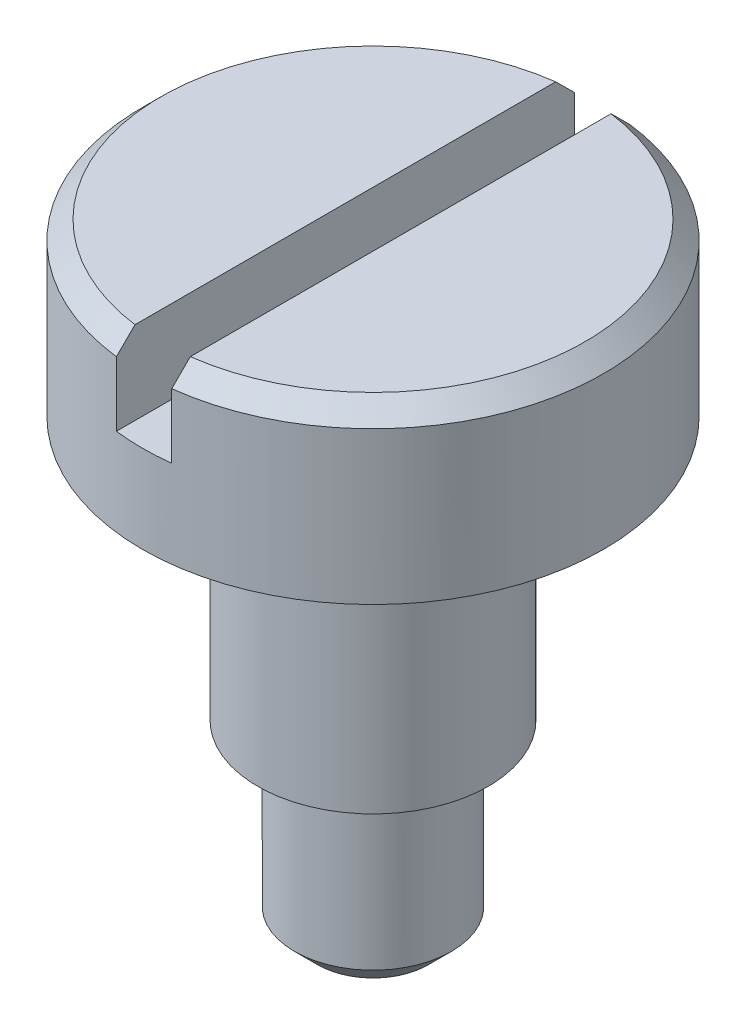
ISO-10303-21;
HEADER;
FILE_DESCRIPTION(('STEP AP214'),'2;1');
FILE_NAME('part.step','',(''),(''),'','','');
FILE_SCHEMA(('AUTOMOTIVE_DESIGN { 1 0 10303 214 1 1 1 1 }'));
ENDSEC;
DATA;
#1=APPLICATION_CONTEXT('core data for automotive mechanical design processes');
#2=APPLICATION_PROTOCOL_DEFINITION('international standard','automotive_design',2000,#1);
#3=PRODUCT_CONTEXT('',#1,'mechanical');
#4=PRODUCT('Part','Part','',(#3));
#5=PRODUCT_RELATED_PRODUCT_CATEGORY('part','',(#4));
#6=PRODUCT_DEFINITION_FORMATION('','',#4);
#7=PRODUCT_DEFINITION_CONTEXT('part definition',#1,'design');
#8=PRODUCT_DEFINITION('design','',#6,#7);
#9=PRODUCT_DEFINITION_SHAPE('','',#8);
#10=(LENGTH_UNIT() NAMED_UNIT(*) SI_UNIT(.MILLI.,.METRE.));
#11=(NAMED_UNIT(*) PLANE_ANGLE_UNIT() SI_UNIT($,.RADIAN.));
#12=(NAMED_UNIT(*) SI_UNIT($,.STERADIAN.) SOLID_ANGLE_UNIT());
#13=UNCERTAINTY_MEASURE_WITH_UNIT(LENGTH_MEASURE(1.E-05),#10,'distance_accuracy_value','');
#14=(GEOMETRIC_REPRESENTATION_CONTEXT(3) GLOBAL_UNCERTAINTY_ASSIGNED_CONTEXT((#13)) GLOBAL_UNIT_ASSIGNED_CONTEXT((#10,
#11,#12)) REPRESENTATION_CONTEXT('',''));
#15=CARTESIAN_POINT('',(0.,0.,0.));
#16=DIRECTION('',(0.,0.,1.));
#17=DIRECTION('',(1.,0.,0.));
#18=AXIS2_PLACEMENT_3D('',#15,#16,#17);
#19=CARTESIAN_POINT('',(0.,6.7,0.));
#20=DIRECTION('',(0.,1.,0.));
#21=DIRECTION('',(0.,0.,1.));
#22=AXIS2_PLACEMENT_3D('',#19,#20,#21);
#23=PLANE('',#22);
#24=DIRECTION('',(0.,0.,1.));
#25=VECTOR('',#24,1.);
#26=CARTESIAN_POINT('',(-0.3,6.7,-2.5));
#27=LINE('',#26,#25);
#28=CARTESIAN_POINT('',(-0.3,6.7,-2.28035085019828));
#29=VERTEX_POINT('',#28);
#30=CARTESIAN_POINT('',(-0.3,6.7,2.28035085019828));
#31=VERTEX_POINT('',#30);
#32=EDGE_CURVE('E119',#29,#31,#27,.T.);
#33=ORIENTED_EDGE('',*,*,#32,.F.);
#34=CARTESIAN_POINT('',(0.,6.7,0.));
#35=DIRECTION('',(0.,1.,0.));
#36=DIRECTION('',(0.,0.,1.));
#37=AXIS2_PLACEMENT_3D('',#34,#35,#36);
#38=CIRCLE('',#37,2.3);
#39=EDGE_CURVE('E124',#29,#31,#38,.T.);
#40=ORIENTED_EDGE('',*,*,#39,.T.);
#41=EDGE_LOOP('',(#33,#40));
#42=FACE_BOUND('',#41,.T.);
#43=ADVANCED_FACE('F51',(#42),#23,.T.);
#44=CARTESIAN_POINT('',(0.,6.7,0.));
#45=DIRECTION('',(0.,-1.,0.));
#46=DIRECTION('',(0.,0.,-1.));
#47=AXIS2_PLACEMENT_3D('',#44,#45,#46);
#48=CONICAL_SURFACE('',#47,2.3,0.785398163397449);
#49=CARTESIAN_POINT('',(-0.3,3.49740095923277,-5.49441500102172));
#50=CARTESIAN_POINT('',(-0.3,3.68437904184473,-5.30715620001564));
#51=CARTESIAN_POINT('',(-0.3,3.87134497413537,-5.11988525896128));
#52=CARTESIAN_POINT('',(-0.3,4.24523879282245,-4.74530183687046));
#53=CARTESIAN_POINT('',(-0.3,4.4321666788391,-4.55798935545493));
#54=CARTESIAN_POINT('',(-0.3,4.80600752109222,-4.18326864041074));
#55=CARTESIAN_POINT('',(-0.3,4.99292046535317,-3.99586039483432));
#56=CARTESIAN_POINT('',(-0.3,5.36666126046775,-3.62096252581089));
#57=CARTESIAN_POINT('',(-0.3,5.55348911209646,-3.43347290313678));
#58=CARTESIAN_POINT('',(-0.3,5.93259363628316,-3.05275236081743));
#59=CARTESIAN_POINT('',(-0.3,6.12486622374014,-2.85951737380285));
#60=CARTESIAN_POINT('',(-0.3,6.50916973886682,-2.47279638791687));
#61=CARTESIAN_POINT('',(-0.3,6.70120065974709,-2.27931038229033));
#62=CARTESIAN_POINT('',(-0.3,6.98883994321344,-1.98870504849486));
#63=CARTESIAN_POINT('',(-0.3,7.08464520469283,-1.89178063812496));
#64=CARTESIAN_POINT('',(-0.3,7.2760484612754,-1.69772498146762));
#65=CARTESIAN_POINT('',(-0.3,7.3716464541014,-1.60059373293074));
#66=CARTESIAN_POINT('',(-0.3,7.56248499619252,-1.40599070199035));
#67=CARTESIAN_POINT('',(-0.3,7.65772556354288,-1.30851893731182));
#68=CARTESIAN_POINT('',(-0.3,7.8475700351555,-1.11295789524718));
#69=CARTESIAN_POINT('',(-0.3,7.94217395453813,-1.01486863263448));
#70=CARTESIAN_POINT('',(-0.3,8.06135458075425,-0.889449161834405));
#71=CARTESIAN_POINT('',(-0.3,8.08660989895674,-0.862765153019541));
#72=CARTESIAN_POINT('',(-0.3,8.13697244199038,-0.809257484328843));
#73=CARTESIAN_POINT('',(-0.3,8.16207966464868,-0.782433822414863));
#74=CARTESIAN_POINT('',(-0.3,8.23697387926633,-0.701863728148212));
#75=CARTESIAN_POINT('',(-0.3,8.28648621187903,-0.647858293090638));
#76=CARTESIAN_POINT('',(-0.3,8.36791155472844,-0.55659925920069));
#77=CARTESIAN_POINT('',(-0.3,8.4002319010554,-0.519709452316788));
#78=CARTESIAN_POINT('',(-0.3,8.46391254944531,-0.444742714247727));
#79=CARTESIAN_POINT('',(-0.3,8.49526667156229,-0.406660416311502));
#80=CARTESIAN_POINT('',(-0.3,8.54073883723581,-0.347953844083806));
#81=CARTESIAN_POINT('',(-0.3,8.55571817198022,-0.328001395001935));
#82=CARTESIAN_POINT('',(-0.3,8.58476156349011,-0.287445666051435));
#83=CARTESIAN_POINT('',(-0.3,8.59882603484562,-0.266842687361308));
#84=CARTESIAN_POINT('',(-0.3,8.62543261767438,-0.224863157128301));
#85=CARTESIAN_POINT('',(-0.3,8.6379846957021,-0.203493029495873));
#86=CARTESIAN_POINT('',(-0.3,8.66072805776845,-0.159554908096857));
#87=CARTESIAN_POINT('',(-0.3,8.67092658182345,-0.13699085767192));
#88=CARTESIAN_POINT('',(-0.3,8.68546935898964,-0.0959344492746688));
#89=CARTESIAN_POINT('',(-0.3,8.69062790945145,-0.0777424058236855));
#90=CARTESIAN_POINT('',(-0.3,8.69777730964675,-0.0407827119720146));
#91=CARTESIAN_POINT('',(-0.3,8.69978090316367,-0.0220176909914338));
#92=CARTESIAN_POINT('',(-0.3,8.70018518531182,0.0156381589663874));
#93=CARTESIAN_POINT('',(-0.3,8.6985696883187,0.0345291748905424));
#94=CARTESIAN_POINT('',(-0.3,8.69208591362269,0.0717752076342206));
#95=CARTESIAN_POINT('',(-0.3,8.68720601879649,0.0901280649380028));
#96=CARTESIAN_POINT('',(-0.3,8.67470643947542,0.127028226162946));
#97=CARTESIAN_POINT('',(-0.3,8.66694415511521,0.145524972778849));
#98=CARTESIAN_POINT('',(-0.3,8.64963631889314,0.181678712199913));
#99=CARTESIAN_POINT('',(-0.3,8.64008739297465,0.199334035500835));
#100=CARTESIAN_POINT('',(-0.3,8.61974330234294,0.234083326816711));
#101=CARTESIAN_POINT('',(-0.3,8.60893902906366,0.251171865837647));
#102=CARTESIAN_POINT('',(-0.3,8.58653780503082,0.28479224562154));
#103=CARTESIAN_POINT('',(-0.3,8.57494157785009,0.301324574485331));
#104=CARTESIAN_POINT('',(-0.3,8.53712591947314,0.353359098089127));
#105=CARTESIAN_POINT('',(-0.3,8.50987442444216,0.388105482828248));
#106=CARTESIAN_POINT('',(-0.3,8.4540641554594,0.456538378601001));
#107=CARTESIAN_POINT('',(-0.3,8.42550457413641,0.490224212802764));
#108=CARTESIAN_POINT('',(-0.3,8.36757227673619,0.556992808389135));
#109=CARTESIAN_POINT('',(-0.3,8.33819821555706,0.590074401537634));
#110=CARTESIAN_POINT('',(-0.3,8.27898135488323,0.65579571299571));
#111=CARTESIAN_POINT('',(-0.3,8.24913868876631,0.688435552286678));
#112=CARTESIAN_POINT('',(-0.3,8.15933430051511,0.785715993452223));
#113=CARTESIAN_POINT('',(-0.3,8.09890916030533,0.849928070452521));
#114=CARTESIAN_POINT('',(-0.3,7.97750059498292,0.977693187892755));
#115=CARTESIAN_POINT('',(-0.3,7.91651780282345,1.04124683423659));
#116=CARTESIAN_POINT('',(-0.3,7.73356110975403,1.2308517311696));
#117=CARTESIAN_POINT('',(-0.3,7.61106147849989,1.35639527890478));
#118=CARTESIAN_POINT('',(-0.3,7.36548846923433,1.6069221557674));
#119=CARTESIAN_POINT('',(-0.3,7.24241507865409,1.73190547250363));
#120=CARTESIAN_POINT('',(-0.3,6.9959046371281,1.98161557427296));
#121=CARTESIAN_POINT('',(-0.3,6.87246745659262,2.10634223150332));
#122=CARTESIAN_POINT('',(-0.3,6.62541415244908,2.35561585955636));
#123=CARTESIAN_POINT('',(-0.3,6.5017980303684,2.48016283189483));
#124=CARTESIAN_POINT('',(-0.3,6.13075740493485,2.8536615007864));
#125=CARTESIAN_POINT('',(-0.3,5.88316497133436,3.10244637086134));
#126=CARTESIAN_POINT('',(-0.3,5.38780211847215,3.5997834009693));
#127=CARTESIAN_POINT('',(-0.3,5.14003172214028,3.84833558386133));
#128=CARTESIAN_POINT('',(-0.3,4.77600091553271,4.21334065594416));
#129=CARTESIAN_POINT('',(-0.3,4.65978679977968,4.32983970942582));
#130=CARTESIAN_POINT('',(-0.3,4.42733473190355,4.56282033079932));
#131=CARTESIAN_POINT('',(-0.3,4.31109677921989,4.67930189813183));
#132=CARTESIAN_POINT('',(-0.3,4.07862187134336,4.91223122439401));
#133=CARTESIAN_POINT('',(-0.3,3.96238491860602,5.02867898577443));
#134=CARTESIAN_POINT('',(-0.3,3.7299007150748,5.26155791420399));
#135=CARTESIAN_POINT('',(-0.3,3.61365346464633,5.3779890816179));
#136=CARTESIAN_POINT('',(-0.3,3.49740095923277,5.49441500102172));
#137=B_SPLINE_CURVE_WITH_KNOTS('',3,(#49,#50,#51,#52,#53,#54,#55,#56,#57,#58,#59,#60,#61,#62,
#63,#64,#65,#66,#67,#68,#69,#70,#71,#72,#73,#74,#75,#76,#77,#78,#79,#80,#81,#82,#83,#84,#85,#86,
#87,#88,#89,#90,#91,#92,#93,#94,#95,#96,#97,#98,#99,#100,#101,#102,#103,#104,#105,#106,#107,
#108,#109,#110,#111,#112,#113,#114,#115,#116,#117,#118,#119,#120,#121,#122,#123,#124,#125,#126,
#127,#128,#129,#130,#131,#132,#133,#134,#135,#136),.UNSPECIFIED.,.F.,.F.,(4,2,2,2,2,2,2,2,2,2,2,
2,2,2,2,2,2,2,2,2,2,2,2,2,2,2,2,2,2,2,2,2,2,2,2,2,2,2,2,2,2,2,2,4),(0.,0.793876546364031,
1.58776066268283,2.38181650155653,3.17586495682467,3.99365253034857,4.81146258775994,
5.22031074168229,5.62916336490971,6.03799501403457,6.44681691890672,6.55703786995822,
6.66726043414782,6.88704208752998,7.03417144534583,7.18210127994141,7.2569344365678,
7.33173344121863,7.40600889829883,7.48005272899999,7.53657161101339,7.5928616058636,
7.64940384825497,7.70614838754923,7.76618693055665,7.82634002164501,7.88696060016449,
7.94752651479469,8.079922895979,8.2124021254584,8.3451149740822,8.47779071011941,
8.7422974836184,9.00653421330329,9.53274606785147,10.0589695043175,10.5854110559238,
11.1118481402548,12.1648260581468,13.2176865404689,13.7113460853179,14.2050190064523,
14.6986180254373,15.1922036393833),.UNSPECIFIED.);
#138=CARTESIAN_POINT('',(-0.3,6.5,-2.48193472919818));
#139=VERTEX_POINT('',#138);
#140=EDGE_CURVE('E198',#139,#29,#137,.T.);
#141=ORIENTED_EDGE('',*,*,#140,.F.);
#142=CARTESIAN_POINT('',(0.,6.5,0.));
#143=DIRECTION('',(0.,1.,0.));
#144=DIRECTION('',(0.,0.,1.));
#145=AXIS2_PLACEMENT_3D('',#142,#143,#144);
#146=CIRCLE('',#145,2.5);
#147=CARTESIAN_POINT('',(-0.3,6.5,2.48193472919817));
#148=VERTEX_POINT('',#147);
#149=EDGE_CURVE('E126',#148,#139,#146,.F.);
#150=ORIENTED_EDGE('',*,*,#149,.F.);
#151=EDGE_CURVE('E112',#31,#148,#137,.T.);
#152=ORIENTED_EDGE('',*,*,#151,.F.);
#153=ORIENTED_EDGE('',*,*,#39,.F.);
#154=EDGE_LOOP('',(#141,#150,#152,#153));
#155=FACE_BOUND('',#154,.T.);
#156=ADVANCED_FACE('F173',(#155),#48,.T.);
#157=CARTESIAN_POINT('',(0.,2.,0.));
#158=DIRECTION('',(0.,-1.,0.));
#159=DIRECTION('',(0.,0.,-1.));
#160=AXIS2_PLACEMENT_3D('',#157,#158,#159);
#161=PLANE('',#160);
#162=CARTESIAN_POINT('',(0.,2.,0.));
#163=DIRECTION('',(0.,-1.,0.));
#164=DIRECTION('',(0.,0.,-1.));
#165=AXIS2_PLACEMENT_3D('',#162,#163,#164);
#166=CIRCLE('',#165,0.85);
#167=CARTESIAN_POINT('',(0.,2.,-0.85));
#168=VERTEX_POINT('',#167);
#169=EDGE_CURVE('E129',#168,#168,#166,.T.);
#170=ORIENTED_EDGE('',*,*,#169,.F.);
#171=EDGE_LOOP('',(#170));
#172=FACE_BOUND('',#171,.T.);
#173=CARTESIAN_POINT('',(0.,2.,0.));
#174=DIRECTION('',(0.,-1.,0.));
#175=DIRECTION('',(0.,0.,-1.));
#176=AXIS2_PLACEMENT_3D('',#173,#174,#175);
#177=CIRCLE('',#176,1.25);
#178=CARTESIAN_POINT('',(0.,2.,-1.25));
#179=VERTEX_POINT('',#178);
#180=EDGE_CURVE('E224',#179,#179,#177,.T.);
#181=ORIENTED_EDGE('',*,*,#180,.T.);
#182=EDGE_LOOP('',(#181));
#183=FACE_BOUND('',#182,.T.);
#184=ADVANCED_FACE('F169',(#172,#183),#161,.T.);
#185=CARTESIAN_POINT('',(0.,2.,0.));
#186=DIRECTION('',(0.,-1.,0.));
#187=DIRECTION('',(0.,0.,-1.));
#188=AXIS2_PLACEMENT_3D('',#185,#186,#187);
#189=CYLINDRICAL_SURFACE('',#188,0.85);
#190=CARTESIAN_POINT('',(0.,0.250000000000002,0.));
#191=DIRECTION('',(0.,1.,0.));
#192=DIRECTION('',(0.,0.,1.));
#193=AXIS2_PLACEMENT_3D('',#190,#191,#192);
#194=CIRCLE('',#193,0.85);
#195=CARTESIAN_POINT('',(0.,0.250000000000002,0.85));
#196=VERTEX_POINT('',#195);
#197=EDGE_CURVE('E208',#196,#196,#194,.T.);
#198=ORIENTED_EDGE('',*,*,#197,.T.);
#199=EDGE_LOOP('',(#198));
#200=FACE_BOUND('',#199,.T.);
#201=ORIENTED_EDGE('',*,*,#169,.T.);
#202=EDGE_LOOP('',(#201));
#203=FACE_BOUND('',#202,.T.);
#204=ADVANCED_FACE('F166',(#200,#203),#189,.T.);
#205=CARTESIAN_POINT('',(0.,0.,0.));
#206=DIRECTION('',(0.,1.,0.));
#207=DIRECTION('',(0.,0.,1.));
#208=AXIS2_PLACEMENT_3D('',#205,#206,#207);
#209=PLANE('',#208);
#210=CARTESIAN_POINT('',(0.,0.,0.));
#211=DIRECTION('',(0.,1.,0.));
#212=DIRECTION('',(0.,0.,1.));
#213=AXIS2_PLACEMENT_3D('',#210,#211,#212);
#214=CIRCLE('',#213,0.599999999999999);
#215=CARTESIAN_POINT('',(0.,0.,0.599999999999999));
#216=VERTEX_POINT('',#215);
#217=EDGE_CURVE('E204',#216,#216,#214,.F.);
#218=ORIENTED_EDGE('',*,*,#217,.T.);
#219=EDGE_LOOP('',(#218));
#220=FACE_BOUND('',#219,.T.);
#221=ADVANCED_FACE('F164',(#220),#209,.F.);
#222=CARTESIAN_POINT('',(0.,4.85,0.));
#223=DIRECTION('',(0.,-1.,0.));
#224=DIRECTION('',(0.,0.,-1.));
#225=AXIS2_PLACEMENT_3D('',#222,#223,#224);
#226=PLANE('',#225);
#227=CARTESIAN_POINT('',(0.,4.85,0.));
#228=DIRECTION('',(0.,-1.,0.));
#229=DIRECTION('',(0.,0.,-1.));
#230=AXIS2_PLACEMENT_3D('',#227,#228,#229);
#231=CIRCLE('',#230,1.35);
#232=CARTESIAN_POINT('',(0.,4.85,-1.35));
#233=VERTEX_POINT('',#232);
#234=EDGE_CURVE('E14',#233,#233,#231,.F.);
#235=ORIENTED_EDGE('',*,*,#234,.T.);
#236=EDGE_LOOP('',(#235));
#237=FACE_BOUND('',#236,.T.);
#238=CARTESIAN_POINT('',(0.,4.85,0.));
#239=DIRECTION('',(0.,-1.,0.));
#240=DIRECTION('',(0.,0.,-1.));
#241=AXIS2_PLACEMENT_3D('',#238,#239,#240);
#242=CIRCLE('',#241,2.5);
#243=CARTESIAN_POINT('',(0.,4.85,-2.5));
#244=VERTEX_POINT('',#243);
#245=EDGE_CURVE('E131',#244,#244,#242,.T.);
#246=ORIENTED_EDGE('',*,*,#245,.T.);
#247=EDGE_LOOP('',(#246));
#248=FACE_BOUND('',#247,.T.);
#249=ADVANCED_FACE('F160',(#237,#248),#226,.T.);
#250=CARTESIAN_POINT('',(0.,4.85,0.));
#251=DIRECTION('',(0.,-1.,0.));
#252=DIRECTION('',(0.,0.,-1.));
#253=AXIS2_PLACEMENT_3D('',#250,#251,#252);
#254=CYLINDRICAL_SURFACE('',#253,1.25);
#255=CARTESIAN_POINT('',(0.,4.75,0.));
#256=DIRECTION('',(0.,-1.,0.));
#257=DIRECTION('',(0.,0.,-1.));
#258=AXIS2_PLACEMENT_3D('',#255,#256,#257);
#259=CIRCLE('',#258,1.25);
#260=CARTESIAN_POINT('',(0.,4.75,-1.25));
#261=VERTEX_POINT('',#260);
#262=EDGE_CURVE('E59',#261,#261,#259,.T.);
#263=ORIENTED_EDGE('',*,*,#262,.T.);
#264=EDGE_LOOP('',(#263));
#265=FACE_BOUND('',#264,.T.);
#266=ORIENTED_EDGE('',*,*,#180,.F.);
#267=EDGE_LOOP('',(#266));
#268=FACE_BOUND('',#267,.T.);
#269=ADVANCED_FACE('F157',(#265,#268),#254,.T.);
#270=DIRECTION('',(0.,0.,1.));
#271=VECTOR('',#270,1.);
#272=CARTESIAN_POINT('',(0.3,6.7,-2.5));
#273=LINE('',#272,#271);
#274=CARTESIAN_POINT('',(0.3,6.7,-2.28035085019828));
#275=VERTEX_POINT('',#274);
#276=CARTESIAN_POINT('',(0.3,6.7,2.28035085019828));
#277=VERTEX_POINT('',#276);
#278=EDGE_CURVE('E66',#275,#277,#273,.T.);
#279=ORIENTED_EDGE('',*,*,#278,.T.);
#280=EDGE_CURVE('E118',#277,#275,#38,.T.);
#281=ORIENTED_EDGE('',*,*,#280,.T.);
#282=EDGE_LOOP('',(#279,#281));
#283=FACE_BOUND('',#282,.T.);
#284=ADVANCED_FACE('F117',(#283),#23,.T.);
#285=CARTESIAN_POINT('',(0.,6.7,0.));
#286=DIRECTION('',(0.,-1.,0.));
#287=DIRECTION('',(0.,0.,-1.));
#288=AXIS2_PLACEMENT_3D('',#285,#286,#287);
#289=CYLINDRICAL_SURFACE('',#288,2.5);
#290=CARTESIAN_POINT('',(0.,5.8,0.));
#291=DIRECTION('',(0.,-1.,0.));
#292=DIRECTION('',(0.,0.,-1.));
#293=AXIS2_PLACEMENT_3D('',#290,#291,#292);
#294=CIRCLE('',#293,2.5);
#295=CARTESIAN_POINT('',(-0.3,5.8,-2.48193472919817));
#296=VERTEX_POINT('',#295);
#297=CARTESIAN_POINT('',(0.3,5.8,-2.48193472919817));
#298=VERTEX_POINT('',#297);
#299=EDGE_CURVE('E203',#296,#298,#294,.T.);
#300=ORIENTED_EDGE('',*,*,#299,.T.);
#301=DIRECTION('',(0.,-1.,0.));
#302=VECTOR('',#301,1.);
#303=CARTESIAN_POINT('',(0.3,6.7,-2.48193472919817));
#304=LINE('',#303,#302);
#305=CARTESIAN_POINT('',(0.3,6.5,-2.48193472919817));
#306=VERTEX_POINT('',#305);
#307=EDGE_CURVE('E195',#298,#306,#304,.F.);
#308=ORIENTED_EDGE('',*,*,#307,.T.);
#309=CARTESIAN_POINT('',(0.3,6.5,2.48193472919818));
#310=VERTEX_POINT('',#309);
#311=EDGE_CURVE('E123',#306,#310,#146,.F.);
#312=ORIENTED_EDGE('',*,*,#311,.T.);
#313=DIRECTION('',(0.,-1.,0.));
#314=VECTOR('',#313,1.);
#315=CARTESIAN_POINT('',(0.3,6.7,2.48193472919817));
#316=LINE('',#315,#314);
#317=CARTESIAN_POINT('',(0.3,5.8,2.48193472919817));
#318=VERTEX_POINT('',#317);
#319=EDGE_CURVE('E107',#310,#318,#316,.T.);
#320=ORIENTED_EDGE('',*,*,#319,.T.);
#321=CARTESIAN_POINT('',(-0.3,5.8,2.48193472919817));
#322=VERTEX_POINT('',#321);
#323=EDGE_CURVE('E201',#318,#322,#294,.T.);
#324=ORIENTED_EDGE('',*,*,#323,.T.);
#325=DIRECTION('',(0.,-1.,0.));
#326=VECTOR('',#325,1.);
#327=CARTESIAN_POINT('',(-0.3,6.7,2.48193472919817));
#328=LINE('',#327,#326);
#329=EDGE_CURVE('E230',#322,#148,#328,.F.);
#330=ORIENTED_EDGE('',*,*,#329,.T.);
#331=ORIENTED_EDGE('',*,*,#149,.T.);
#332=DIRECTION('',(0.,-1.,0.));
#333=VECTOR('',#332,1.);
#334=CARTESIAN_POINT('',(-0.3,6.7,-2.48193472919817));
#335=LINE('',#334,#333);
#336=EDGE_CURVE('E74',#139,#296,#335,.T.);
#337=ORIENTED_EDGE('',*,*,#336,.T.);
#338=EDGE_LOOP('',(#300,#308,#312,#320,#324,#330,#331,#337));
#339=FACE_BOUND('',#338,.T.);
#340=ORIENTED_EDGE('',*,*,#245,.F.);
#341=EDGE_LOOP('',(#340));
#342=FACE_BOUND('',#341,.T.);
#343=ADVANCED_FACE('F177',(#339,#342),#289,.T.);
#344=CARTESIAN_POINT('',(0.3,3.49740095923277,5.49441500102172));
#345=CARTESIAN_POINT('',(0.3,3.68437904184473,5.30715620001564));
#346=CARTESIAN_POINT('',(0.3,3.87134497413537,5.11988525896128));
#347=CARTESIAN_POINT('',(0.3,4.24523879282245,4.74530183687046));
#348=CARTESIAN_POINT('',(0.3,4.4321666788391,4.55798935545493));
#349=CARTESIAN_POINT('',(0.3,4.80600752109222,4.18326864041074));
#350=CARTESIAN_POINT('',(0.3,4.99292046535317,3.99586039483432));
#351=CARTESIAN_POINT('',(0.3,5.36666126046775,3.62096252581089));
#352=CARTESIAN_POINT('',(0.3,5.55348911209646,3.43347290313678));
#353=CARTESIAN_POINT('',(0.3,5.93259363628316,3.05275236081743));
#354=CARTESIAN_POINT('',(0.3,6.12486622374014,2.85951737380285));
#355=CARTESIAN_POINT('',(0.3,6.50916973886682,2.47279638791687));
#356=CARTESIAN_POINT('',(0.3,6.70120065974709,2.27931038229033));
#357=CARTESIAN_POINT('',(0.3,6.98883994321344,1.98870504849486));
#358=CARTESIAN_POINT('',(0.3,7.08464520469283,1.89178063812496));
#359=CARTESIAN_POINT('',(0.3,7.2760484612754,1.69772498146762));
#360=CARTESIAN_POINT('',(0.3,7.3716464541014,1.60059373293074));
#361=CARTESIAN_POINT('',(0.3,7.56248499619252,1.40599070199035));
#362=CARTESIAN_POINT('',(0.3,7.65772556354288,1.30851893731182));
#363=CARTESIAN_POINT('',(0.3,7.8475700351555,1.11295789524718));
#364=CARTESIAN_POINT('',(0.3,7.94217395453813,1.01486863263448));
#365=CARTESIAN_POINT('',(0.3,8.06135458075425,0.889449161834405));
#366=CARTESIAN_POINT('',(0.3,8.08660989895674,0.862765153019541));
#367=CARTESIAN_POINT('',(0.3,8.13697244199038,0.809257484328843));
#368=CARTESIAN_POINT('',(0.3,8.16207966464868,0.782433822414863));
#369=CARTESIAN_POINT('',(0.3,8.23697387926633,0.701863728148212));
#370=CARTESIAN_POINT('',(0.3,8.28648621187903,0.647858293090638));
#371=CARTESIAN_POINT('',(0.3,8.36791155472844,0.55659925920069));
#372=CARTESIAN_POINT('',(0.3,8.4002319010554,0.519709452316788));
#373=CARTESIAN_POINT('',(0.3,8.46391254944531,0.444742714247727));
#374=CARTESIAN_POINT('',(0.3,8.49526667156229,0.406660416311502));
#375=CARTESIAN_POINT('',(0.3,8.54073883723581,0.347953844083806));
#376=CARTESIAN_POINT('',(0.3,8.55571817198022,0.328001395001935));
#377=CARTESIAN_POINT('',(0.3,8.58476156349011,0.287445666051435));
#378=CARTESIAN_POINT('',(0.3,8.59882603484562,0.266842687361308));
#379=CARTESIAN_POINT('',(0.3,8.62543261767438,0.224863157128301));
#380=CARTESIAN_POINT('',(0.3,8.6379846957021,0.203493029495873));
#381=CARTESIAN_POINT('',(0.3,8.66072805776845,0.159554908096857));
#382=CARTESIAN_POINT('',(0.3,8.67092658182345,0.13699085767192));
#383=CARTESIAN_POINT('',(0.3,8.68546935898964,0.0959344492746688));
#384=CARTESIAN_POINT('',(0.3,8.69062790945145,0.0777424058236855));
#385=CARTESIAN_POINT('',(0.3,8.69777730964675,0.0407827119720146));
#386=CARTESIAN_POINT('',(0.3,8.69978090316367,0.0220176909914338));
#387=CARTESIAN_POINT('',(0.3,8.70018518531182,-0.0156381589663874));
#388=CARTESIAN_POINT('',(0.3,8.6985696883187,-0.0345291748905424));
#389=CARTESIAN_POINT('',(0.3,8.69208591362269,-0.0717752076342206));
#390=CARTESIAN_POINT('',(0.3,8.68720601879649,-0.0901280649380028));
#391=CARTESIAN_POINT('',(0.3,8.67470643947542,-0.127028226162946));
#392=CARTESIAN_POINT('',(0.3,8.66694415511521,-0.145524972778849));
#393=CARTESIAN_POINT('',(0.3,8.64963631889314,-0.181678712199913));
#394=CARTESIAN_POINT('',(0.3,8.64008739297465,-0.199334035500835));
#395=CARTESIAN_POINT('',(0.3,8.61974330234294,-0.234083326816711));
#396=CARTESIAN_POINT('',(0.3,8.60893902906366,-0.251171865837647));
#397=CARTESIAN_POINT('',(0.3,8.58653780503082,-0.28479224562154));
#398=CARTESIAN_POINT('',(0.3,8.57494157785009,-0.301324574485331));
#399=CARTESIAN_POINT('',(0.3,8.53712591947314,-0.353359098089127));
#400=CARTESIAN_POINT('',(0.3,8.50987442444216,-0.388105482828248));
#401=CARTESIAN_POINT('',(0.3,8.4540641554594,-0.456538378601001));
#402=CARTESIAN_POINT('',(0.3,8.42550457413641,-0.490224212802764));
#403=CARTESIAN_POINT('',(0.3,8.36757227673619,-0.556992808389135));
#404=CARTESIAN_POINT('',(0.3,8.33819821555706,-0.590074401537634));
#405=CARTESIAN_POINT('',(0.3,8.27898135488323,-0.65579571299571));
#406=CARTESIAN_POINT('',(0.3,8.24913868876631,-0.688435552286678));
#407=CARTESIAN_POINT('',(0.3,8.15933430051511,-0.785715993452223));
#408=CARTESIAN_POINT('',(0.3,8.09890916030533,-0.849928070452521));
#409=CARTESIAN_POINT('',(0.3,7.97750059498292,-0.977693187892755));
#410=CARTESIAN_POINT('',(0.3,7.91651780282345,-1.04124683423659));
#411=CARTESIAN_POINT('',(0.3,7.73356110975403,-1.2308517311696));
#412=CARTESIAN_POINT('',(0.3,7.61106147849989,-1.35639527890478));
#413=CARTESIAN_POINT('',(0.3,7.36548846923433,-1.6069221557674));
#414=CARTESIAN_POINT('',(0.3,7.24241507865409,-1.73190547250363));
#415=CARTESIAN_POINT('',(0.3,6.9959046371281,-1.98161557427296));
#416=CARTESIAN_POINT('',(0.3,6.87246745659262,-2.10634223150332));
#417=CARTESIAN_POINT('',(0.3,6.62541415244908,-2.35561585955636));
#418=CARTESIAN_POINT('',(0.3,6.5017980303684,-2.48016283189483));
#419=CARTESIAN_POINT('',(0.3,6.13075740493485,-2.8536615007864));
#420=CARTESIAN_POINT('',(0.3,5.88316497133436,-3.10244637086134));
#421=CARTESIAN_POINT('',(0.3,5.38780211847215,-3.5997834009693));
#422=CARTESIAN_POINT('',(0.3,5.14003172214028,-3.84833558386133));
#423=CARTESIAN_POINT('',(0.3,4.77600091553271,-4.21334065594416));
#424=CARTESIAN_POINT('',(0.3,4.65978679977968,-4.32983970942582));
#425=CARTESIAN_POINT('',(0.3,4.42733473190355,-4.56282033079932));
#426=CARTESIAN_POINT('',(0.3,4.31109677921989,-4.67930189813183));
#427=CARTESIAN_POINT('',(0.3,4.07862187134336,-4.91223122439401));
#428=CARTESIAN_POINT('',(0.3,3.96238491860602,-5.02867898577443));
#429=CARTESIAN_POINT('',(0.3,3.7299007150748,-5.26155791420399));
#430=CARTESIAN_POINT('',(0.3,3.61365346464633,-5.3779890816179));
#431=CARTESIAN_POINT('',(0.3,3.49740095923277,-5.49441500102172));
#432=B_SPLINE_CURVE_WITH_KNOTS('',3,(#344,#345,#346,#347,#348,#349,#350,#351,#352,#353,#354,
#355,#356,#357,#358,#359,#360,#361,#362,#363,#364,#365,#366,#367,#368,#369,#370,#371,#372,#373,
#374,#375,#376,#377,#378,#379,#380,#381,#382,#383,#384,#385,#386,#387,#388,#389,#390,#391,#392,
#393,#394,#395,#396,#397,#398,#399,#400,#401,#402,#403,#404,#405,#406,#407,#408,#409,#410,#411,
#412,#413,#414,#415,#416,#417,#418,#419,#420,#421,#422,#423,#424,#425,#426,#427,#428,#429,#430,
#431),.UNSPECIFIED.,.F.,.F.,(4,2,2,2,2,2,2,2,2,2,2,2,2,2,2,2,2,2,2,2,2,2,2,2,2,2,2,2,2,2,2,2,2,
2,2,2,2,2,2,2,2,2,2,4),(0.,0.793876546364031,1.58776066268283,2.38181650155653,3.17586495682467,
3.99365253034857,4.81146258775994,5.22031074168229,5.62916336490971,6.03799501403457,
6.44681691890672,6.55703786995822,6.66726043414782,6.88704208752998,7.03417144534583,
7.18210127994141,7.2569344365678,7.33173344121863,7.40600889829883,7.48005272899999,
7.53657161101339,7.5928616058636,7.64940384825497,7.70614838754923,7.76618693055665,
7.82634002164501,7.88696060016449,7.94752651479469,8.079922895979,8.2124021254584,
8.3451149740822,8.47779071011941,8.7422974836184,9.00653421330329,9.53274606785147,
10.0589695043175,10.5854110559238,11.1118481402548,12.1648260581468,13.2176865404689,
13.7113460853179,14.2050190064523,14.6986180254373,15.1922036393833),.UNSPECIFIED.);
#433=EDGE_CURVE('E103',#310,#277,#432,.T.);
#434=ORIENTED_EDGE('',*,*,#433,.F.);
#435=ORIENTED_EDGE('',*,*,#311,.F.);
#436=EDGE_CURVE('E113',#275,#306,#432,.T.);
#437=ORIENTED_EDGE('',*,*,#436,.F.);
#438=ORIENTED_EDGE('',*,*,#280,.F.);
#439=EDGE_LOOP('',(#434,#435,#437,#438));
#440=FACE_BOUND('',#439,.T.);
#441=ADVANCED_FACE('F122',(#440),#48,.T.);
#442=CARTESIAN_POINT('',(-0.3,5.8,-2.5));
#443=DIRECTION('',(0.,-1.,0.));
#444=DIRECTION('',(0.,0.,-1.));
#445=AXIS2_PLACEMENT_3D('',#442,#443,#444);
#446=PLANE('',#445);
#447=DIRECTION('',(0.,0.,1.));
#448=VECTOR('',#447,1.);
#449=CARTESIAN_POINT('',(0.3,5.8,-2.5));
#450=LINE('',#449,#448);
#451=EDGE_CURVE('E120',#298,#318,#450,.T.);
#452=ORIENTED_EDGE('',*,*,#451,.F.);
#453=ORIENTED_EDGE('',*,*,#299,.F.);
#454=DIRECTION('',(0.,0.,1.));
#455=VECTOR('',#454,1.);
#456=CARTESIAN_POINT('',(-0.3,5.8,-2.5));
#457=LINE('',#456,#455);
#458=EDGE_CURVE('E237',#296,#322,#457,.T.);
#459=ORIENTED_EDGE('',*,*,#458,.T.);
#460=ORIENTED_EDGE('',*,*,#323,.F.);
#461=EDGE_LOOP('',(#452,#453,#459,#460));
#462=FACE_BOUND('',#461,.T.);
#463=ADVANCED_FACE('F151',(#462),#446,.F.);
#464=CARTESIAN_POINT('',(-0.3,6.7,-2.5));
#465=DIRECTION('',(-1.,0.,0.));
#466=DIRECTION('',(0.,-1.,0.));
#467=AXIS2_PLACEMENT_3D('',#464,#465,#466);
#468=PLANE('',#467);
#469=ORIENTED_EDGE('',*,*,#140,.T.);
#470=ORIENTED_EDGE('',*,*,#32,.T.);
#471=ORIENTED_EDGE('',*,*,#151,.T.);
#472=ORIENTED_EDGE('',*,*,#329,.F.);
#473=ORIENTED_EDGE('',*,*,#458,.F.);
#474=ORIENTED_EDGE('',*,*,#336,.F.);
#475=EDGE_LOOP('',(#469,#470,#471,#472,#473,#474));
#476=FACE_BOUND('',#475,.T.);
#477=ADVANCED_FACE('F150',(#476),#468,.F.);
#478=CARTESIAN_POINT('',(0.3,6.7,-2.5));
#479=DIRECTION('',(1.,0.,0.));
#480=DIRECTION('',(0.,1.,0.));
#481=AXIS2_PLACEMENT_3D('',#478,#479,#480);
#482=PLANE('',#481);
#483=ORIENTED_EDGE('',*,*,#433,.T.);
#484=ORIENTED_EDGE('',*,*,#278,.F.);
#485=ORIENTED_EDGE('',*,*,#436,.T.);
#486=ORIENTED_EDGE('',*,*,#307,.F.);
#487=ORIENTED_EDGE('',*,*,#451,.T.);
#488=ORIENTED_EDGE('',*,*,#319,.F.);
#489=EDGE_LOOP('',(#483,#484,#485,#486,#487,#488));
#490=FACE_BOUND('',#489,.T.);
#491=ADVANCED_FACE('F104',(#490),#482,.F.);
#492=CARTESIAN_POINT('',(0.,0.,0.));
#493=DIRECTION('',(0.,1.,0.));
#494=DIRECTION('',(0.,0.,1.));
#495=AXIS2_PLACEMENT_3D('',#492,#493,#494);
#496=CONICAL_SURFACE('',#495,0.599999999999999,0.785398163397446);
#497=ORIENTED_EDGE('',*,*,#197,.F.);
#498=EDGE_LOOP('',(#497));
#499=FACE_BOUND('',#498,.T.);
#500=ORIENTED_EDGE('',*,*,#217,.F.);
#501=EDGE_LOOP('',(#500));
#502=FACE_BOUND('',#501,.T.);
#503=ADVANCED_FACE('F149',(#499,#502),#496,.T.);
#504=CARTESIAN_POINT('',(0.,4.75,0.));
#505=DIRECTION('',(0.,-1.,0.));
#506=DIRECTION('',(0.,0.,-1.));
#507=AXIS2_PLACEMENT_3D('',#504,#505,#506);
#508=TOROIDAL_SURFACE('',#507,1.35,0.1);
#509=ORIENTED_EDGE('',*,*,#234,.F.);
#510=EDGE_LOOP('',(#509));
#511=FACE_BOUND('',#510,.T.);
#512=ORIENTED_EDGE('',*,*,#262,.F.);
#513=EDGE_LOOP('',(#512));
#514=FACE_BOUND('',#513,.T.);
#515=ADVANCED_FACE('F53',(#511,#514),#508,.F.);
#516=CLOSED_SHELL('',(#43,#156,#184,#204,#221,#249,#269,#284,#343,#441,#463,#477,#491,#503,#515));
#517=MANIFOLD_SOLID_BREP('B2',#516);
#518=ADVANCED_BREP_SHAPE_REPRESENTATION('',(#18,#517),#14);
#519=SHAPE_DEFINITION_REPRESENTATION(#9,#518);
ENDSEC;
END-ISO-10303-21;
